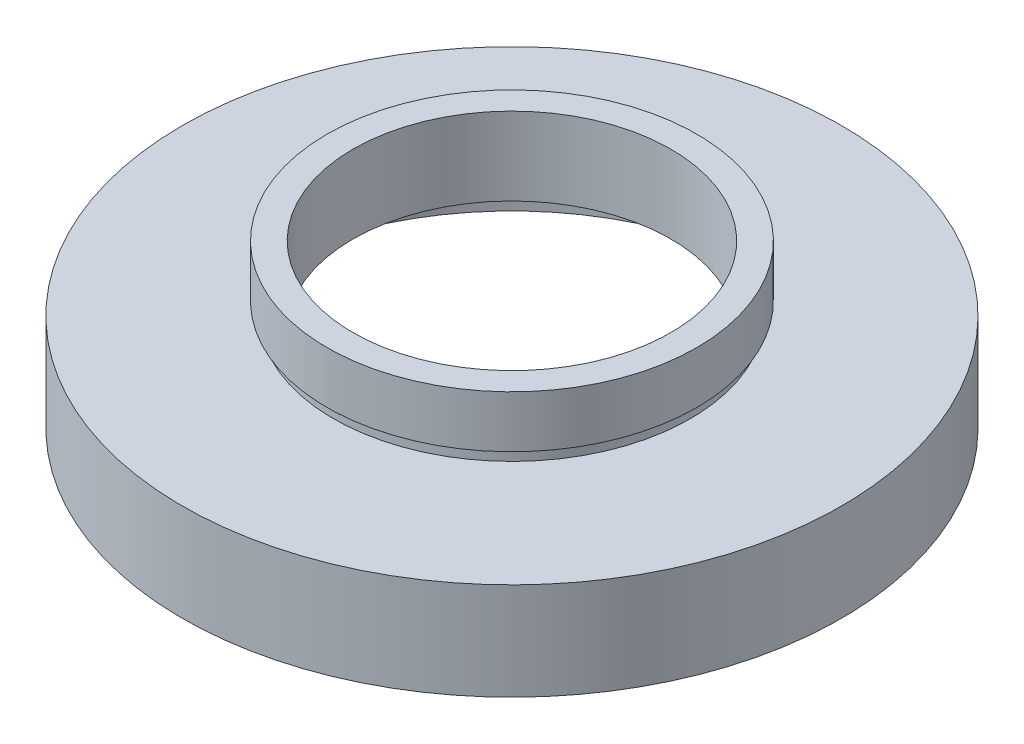
ISO-10303-21;
HEADER;
FILE_DESCRIPTION(('STEP AP214'),'2;1');
FILE_NAME('part.step','',(''),(''),'','','');
FILE_SCHEMA(('AUTOMOTIVE_DESIGN { 1 0 10303 214 1 1 1 1 }'));
ENDSEC;
DATA;
#1=APPLICATION_CONTEXT('core data for automotive mechanical design processes');
#2=APPLICATION_PROTOCOL_DEFINITION('international standard','automotive_design',2000,#1);
#3=PRODUCT_CONTEXT('',#1,'mechanical');
#4=PRODUCT('Part','Part','',(#3));
#5=PRODUCT_RELATED_PRODUCT_CATEGORY('part','',(#4));
#6=PRODUCT_DEFINITION_FORMATION('','',#4);
#7=PRODUCT_DEFINITION_CONTEXT('part definition',#1,'design');
#8=PRODUCT_DEFINITION('design','',#6,#7);
#9=PRODUCT_DEFINITION_SHAPE('','',#8);
#10=(LENGTH_UNIT() NAMED_UNIT(*) SI_UNIT(.MILLI.,.METRE.));
#11=(NAMED_UNIT(*) PLANE_ANGLE_UNIT() SI_UNIT($,.RADIAN.));
#12=(NAMED_UNIT(*) SI_UNIT($,.STERADIAN.) SOLID_ANGLE_UNIT());
#13=UNCERTAINTY_MEASURE_WITH_UNIT(LENGTH_MEASURE(1.E-05),#10,'distance_accuracy_value','');
#14=(GEOMETRIC_REPRESENTATION_CONTEXT(3) GLOBAL_UNCERTAINTY_ASSIGNED_CONTEXT((#13)) GLOBAL_UNIT_ASSIGNED_CONTEXT((#10,
#11,#12)) REPRESENTATION_CONTEXT('',''));
#15=CARTESIAN_POINT('',(0.,0.,0.));
#16=DIRECTION('',(0.,0.,1.));
#17=DIRECTION('',(1.,0.,0.));
#18=AXIS2_PLACEMENT_3D('',#15,#16,#17);
#19=CARTESIAN_POINT('',(25.4,0.,0.));
#20=DIRECTION('',(0.,1.,0.));
#21=DIRECTION('',(-1.,0.,0.));
#22=AXIS2_PLACEMENT_3D('',#19,#20,#21);
#23=PLANE('',#22);
#24=CARTESIAN_POINT('',(0.,0.,0.));
#25=DIRECTION('',(0.,1.,0.));
#26=DIRECTION('',(-1.,0.,0.));
#27=AXIS2_PLACEMENT_3D('',#24,#25,#26);
#28=CIRCLE('',#27,25.4);
#29=CARTESIAN_POINT('',(-25.4,0.,0.));
#30=VERTEX_POINT('',#29);
#31=EDGE_CURVE('E77',#30,#30,#28,.T.);
#32=ORIENTED_EDGE('',*,*,#31,.F.);
#33=EDGE_LOOP('',(#32));
#34=FACE_BOUND('',#33,.T.);
#35=CARTESIAN_POINT('',(0.,0.,0.));
#36=DIRECTION('',(0.,1.,0.));
#37=DIRECTION('',(-1.,0.,0.));
#38=AXIS2_PLACEMENT_3D('',#35,#36,#37);
#39=CIRCLE('',#38,20.5);
#40=CARTESIAN_POINT('',(-20.5,0.,0.));
#41=VERTEX_POINT('',#40);
#42=EDGE_CURVE('E10',#41,#41,#39,.T.);
#43=ORIENTED_EDGE('',*,*,#42,.T.);
#44=EDGE_LOOP('',(#43));
#45=FACE_BOUND('',#44,.T.);
#46=ADVANCED_FACE('F37',(#34,#45),#23,.F.);
#47=CARTESIAN_POINT('',(0.,16.8860182370821,0.));
#48=DIRECTION('',(0.,1.,0.));
#49=DIRECTION('',(-1.,0.,0.));
#50=AXIS2_PLACEMENT_3D('',#47,#48,#49);
#51=CYLINDRICAL_SURFACE('',#50,20.5);
#52=ORIENTED_EDGE('',*,*,#42,.F.);
#53=EDGE_LOOP('',(#52));
#54=FACE_BOUND('',#53,.T.);
#55=CARTESIAN_POINT('',(0.,5.5,0.));
#56=DIRECTION('',(0.,1.,0.));
#57=DIRECTION('',(-1.,0.,0.));
#58=AXIS2_PLACEMENT_3D('',#55,#56,#57);
#59=CIRCLE('',#58,20.5);
#60=CARTESIAN_POINT('',(-20.5,5.5,0.));
#61=VERTEX_POINT('',#60);
#62=EDGE_CURVE('E43',#61,#61,#59,.T.);
#63=ORIENTED_EDGE('',*,*,#62,.T.);
#64=EDGE_LOOP('',(#63));
#65=FACE_BOUND('',#64,.T.);
#66=ADVANCED_FACE('F84',(#54,#65),#51,.F.);
#67=CARTESIAN_POINT('',(20.5,5.5,0.));
#68=DIRECTION('',(0.,-1.,0.));
#69=DIRECTION('',(1.,0.,0.));
#70=AXIS2_PLACEMENT_3D('',#67,#68,#69);
#71=PLANE('',#70);
#72=ORIENTED_EDGE('',*,*,#62,.F.);
#73=EDGE_LOOP('',(#72));
#74=FACE_BOUND('',#73,.T.);
#75=CARTESIAN_POINT('',(0.,5.5,0.));
#76=DIRECTION('',(0.,1.,0.));
#77=DIRECTION('',(-1.,0.,0.));
#78=AXIS2_PLACEMENT_3D('',#75,#76,#77);
#79=CIRCLE('',#78,21.1);
#80=CARTESIAN_POINT('',(-21.1,5.49999999999999,0.));
#81=VERTEX_POINT('',#80);
#82=EDGE_CURVE('E47',#81,#81,#79,.T.);
#83=ORIENTED_EDGE('',*,*,#82,.T.);
#84=EDGE_LOOP('',(#83));
#85=FACE_BOUND('',#84,.T.);
#86=ADVANCED_FACE('F88',(#74,#85),#71,.F.);
#87=CARTESIAN_POINT('',(0.,16.8860182370821,0.));
#88=DIRECTION('',(0.,1.,0.));
#89=DIRECTION('',(-1.,0.,0.));
#90=AXIS2_PLACEMENT_3D('',#87,#88,#89);
#91=CYLINDRICAL_SURFACE('',#90,21.1);
#92=ORIENTED_EDGE('',*,*,#82,.F.);
#93=EDGE_LOOP('',(#92));
#94=FACE_BOUND('',#93,.T.);
#95=CARTESIAN_POINT('',(0.,6.5,0.));
#96=DIRECTION('',(0.,1.,0.));
#97=DIRECTION('',(-1.,0.,0.));
#98=AXIS2_PLACEMENT_3D('',#95,#96,#97);
#99=CIRCLE('',#98,21.1);
#100=CARTESIAN_POINT('',(-21.1,6.49999999999999,0.));
#101=VERTEX_POINT('',#100);
#102=EDGE_CURVE('E51',#101,#101,#99,.T.);
#103=ORIENTED_EDGE('',*,*,#102,.T.);
#104=EDGE_LOOP('',(#103));
#105=FACE_BOUND('',#104,.T.);
#106=ADVANCED_FACE('F93',(#94,#105),#91,.F.);
#107=CARTESIAN_POINT('',(12.25,6.5,0.));
#108=DIRECTION('',(0.,1.,0.));
#109=DIRECTION('',(-1.,0.,0.));
#110=AXIS2_PLACEMENT_3D('',#107,#108,#109);
#111=PLANE('',#110);
#112=ORIENTED_EDGE('',*,*,#102,.F.);
#113=EDGE_LOOP('',(#112));
#114=FACE_BOUND('',#113,.T.);
#115=CARTESIAN_POINT('',(0.,6.5,0.));
#116=DIRECTION('',(0.,1.,0.));
#117=DIRECTION('',(-1.,0.,0.));
#118=AXIS2_PLACEMENT_3D('',#115,#116,#117);
#119=CIRCLE('',#118,12.25);
#120=CARTESIAN_POINT('',(-12.25,6.5,0.));
#121=VERTEX_POINT('',#120);
#122=EDGE_CURVE('E56',#121,#121,#119,.T.);
#123=ORIENTED_EDGE('',*,*,#122,.T.);
#124=EDGE_LOOP('',(#123));
#125=FACE_BOUND('',#124,.T.);
#126=ADVANCED_FACE('F99',(#114,#125),#111,.F.);
#127=CARTESIAN_POINT('',(0.,16.8860182370821,0.));
#128=DIRECTION('',(0.,1.,0.));
#129=DIRECTION('',(-1.,0.,0.));
#130=AXIS2_PLACEMENT_3D('',#127,#128,#129);
#131=CYLINDRICAL_SURFACE('',#130,12.25);
#132=ORIENTED_EDGE('',*,*,#122,.F.);
#133=EDGE_LOOP('',(#132));
#134=FACE_BOUND('',#133,.T.);
#135=CARTESIAN_POINT('',(0.,12.5,0.));
#136=DIRECTION('',(0.,1.,0.));
#137=DIRECTION('',(-1.,0.,0.));
#138=AXIS2_PLACEMENT_3D('',#135,#136,#137);
#139=CIRCLE('',#138,12.25);
#140=CARTESIAN_POINT('',(-12.25,12.5,0.));
#141=VERTEX_POINT('',#140);
#142=EDGE_CURVE('E59',#141,#141,#139,.T.);
#143=ORIENTED_EDGE('',*,*,#142,.T.);
#144=EDGE_LOOP('',(#143));
#145=FACE_BOUND('',#144,.T.);
#146=ADVANCED_FACE('F103',(#134,#145),#131,.F.);
#147=CARTESIAN_POINT('',(12.25,12.5,0.));
#148=DIRECTION('',(0.,-1.,0.));
#149=DIRECTION('',(1.,0.,0.));
#150=AXIS2_PLACEMENT_3D('',#147,#148,#149);
#151=PLANE('',#150);
#152=ORIENTED_EDGE('',*,*,#142,.F.);
#153=EDGE_LOOP('',(#152));
#154=FACE_BOUND('',#153,.T.);
#155=CARTESIAN_POINT('',(0.,12.5,0.));
#156=DIRECTION('',(0.,1.,0.));
#157=DIRECTION('',(-1.,0.,0.));
#158=AXIS2_PLACEMENT_3D('',#155,#156,#157);
#159=CIRCLE('',#158,14.25);
#160=CARTESIAN_POINT('',(-14.25,12.5,0.));
#161=VERTEX_POINT('',#160);
#162=EDGE_CURVE('E62',#161,#161,#159,.T.);
#163=ORIENTED_EDGE('',*,*,#162,.T.);
#164=EDGE_LOOP('',(#163));
#165=FACE_BOUND('',#164,.T.);
#166=ADVANCED_FACE('F107',(#154,#165),#151,.F.);
#167=CARTESIAN_POINT('',(0.,16.8860182370821,0.));
#168=DIRECTION('',(0.,1.,0.));
#169=DIRECTION('',(-1.,0.,0.));
#170=AXIS2_PLACEMENT_3D('',#167,#168,#169);
#171=CYLINDRICAL_SURFACE('',#170,14.25);
#172=ORIENTED_EDGE('',*,*,#162,.F.);
#173=EDGE_LOOP('',(#172));
#174=FACE_BOUND('',#173,.T.);
#175=CARTESIAN_POINT('',(0.,8.5,0.));
#176=DIRECTION('',(0.,1.,0.));
#177=DIRECTION('',(-1.,0.,0.));
#178=AXIS2_PLACEMENT_3D('',#175,#176,#177);
#179=CIRCLE('',#178,14.25);
#180=CARTESIAN_POINT('',(-14.25,8.5,0.));
#181=VERTEX_POINT('',#180);
#182=EDGE_CURVE('E65',#181,#181,#179,.T.);
#183=ORIENTED_EDGE('',*,*,#182,.T.);
#184=EDGE_LOOP('',(#183));
#185=FACE_BOUND('',#184,.T.);
#186=ADVANCED_FACE('F111',(#174,#185),#171,.T.);
#187=CARTESIAN_POINT('',(14.25,8.5,0.));
#188=DIRECTION('',(0.,1.,0.));
#189=DIRECTION('',(-1.,0.,0.));
#190=AXIS2_PLACEMENT_3D('',#187,#188,#189);
#191=PLANE('',#190);
#192=ORIENTED_EDGE('',*,*,#182,.F.);
#193=EDGE_LOOP('',(#192));
#194=FACE_BOUND('',#193,.T.);
#195=CARTESIAN_POINT('',(0.,8.5,0.));
#196=DIRECTION('',(0.,1.,0.));
#197=DIRECTION('',(-1.,0.,0.));
#198=AXIS2_PLACEMENT_3D('',#195,#196,#197);
#199=CIRCLE('',#198,13.75);
#200=CARTESIAN_POINT('',(-13.75,8.5,0.));
#201=VERTEX_POINT('',#200);
#202=EDGE_CURVE('E68',#201,#201,#199,.T.);
#203=ORIENTED_EDGE('',*,*,#202,.T.);
#204=EDGE_LOOP('',(#203));
#205=FACE_BOUND('',#204,.T.);
#206=ADVANCED_FACE('F115',(#194,#205),#191,.F.);
#207=CARTESIAN_POINT('',(0.,16.8860182370821,0.));
#208=DIRECTION('',(0.,1.,0.));
#209=DIRECTION('',(-1.,0.,0.));
#210=AXIS2_PLACEMENT_3D('',#207,#208,#209);
#211=CYLINDRICAL_SURFACE('',#210,13.75);
#212=ORIENTED_EDGE('',*,*,#202,.F.);
#213=EDGE_LOOP('',(#212));
#214=FACE_BOUND('',#213,.T.);
#215=CARTESIAN_POINT('',(0.,7.5,0.));
#216=DIRECTION('',(0.,1.,0.));
#217=DIRECTION('',(-1.,0.,0.));
#218=AXIS2_PLACEMENT_3D('',#215,#216,#217);
#219=CIRCLE('',#218,13.75);
#220=CARTESIAN_POINT('',(-13.75,7.5,0.));
#221=VERTEX_POINT('',#220);
#222=EDGE_CURVE('E71',#221,#221,#219,.T.);
#223=ORIENTED_EDGE('',*,*,#222,.T.);
#224=EDGE_LOOP('',(#223));
#225=FACE_BOUND('',#224,.T.);
#226=ADVANCED_FACE('F119',(#214,#225),#211,.T.);
#227=CARTESIAN_POINT('',(13.75,7.5,0.));
#228=DIRECTION('',(0.,-1.,0.));
#229=DIRECTION('',(1.,0.,0.));
#230=AXIS2_PLACEMENT_3D('',#227,#228,#229);
#231=PLANE('',#230);
#232=ORIENTED_EDGE('',*,*,#222,.F.);
#233=EDGE_LOOP('',(#232));
#234=FACE_BOUND('',#233,.T.);
#235=CARTESIAN_POINT('',(0.,7.5,0.));
#236=DIRECTION('',(0.,1.,0.));
#237=DIRECTION('',(-1.,0.,0.));
#238=AXIS2_PLACEMENT_3D('',#235,#236,#237);
#239=CIRCLE('',#238,25.4);
#240=CARTESIAN_POINT('',(-25.4,7.49999999999999,0.));
#241=VERTEX_POINT('',#240);
#242=EDGE_CURVE('E74',#241,#241,#239,.T.);
#243=ORIENTED_EDGE('',*,*,#242,.T.);
#244=EDGE_LOOP('',(#243));
#245=FACE_BOUND('',#244,.T.);
#246=ADVANCED_FACE('F123',(#234,#245),#231,.F.);
#247=CARTESIAN_POINT('',(0.,16.8860182370821,0.));
#248=DIRECTION('',(0.,1.,0.));
#249=DIRECTION('',(-1.,0.,0.));
#250=AXIS2_PLACEMENT_3D('',#247,#248,#249);
#251=CYLINDRICAL_SURFACE('',#250,25.4);
#252=ORIENTED_EDGE('',*,*,#242,.F.);
#253=EDGE_LOOP('',(#252));
#254=FACE_BOUND('',#253,.T.);
#255=ORIENTED_EDGE('',*,*,#31,.T.);
#256=EDGE_LOOP('',(#255));
#257=FACE_BOUND('',#256,.T.);
#258=ADVANCED_FACE('F81',(#254,#257),#251,.T.);
#259=CLOSED_SHELL('',(#46,#66,#86,#106,#126,#146,#166,#186,#206,#226,#246,#258));
#260=MANIFOLD_SOLID_BREP('B2',#259);
#261=ADVANCED_BREP_SHAPE_REPRESENTATION('',(#18,#260),#14);
#262=SHAPE_DEFINITION_REPRESENTATION(#9,#261);
ENDSEC;
END-ISO-10303-21;
